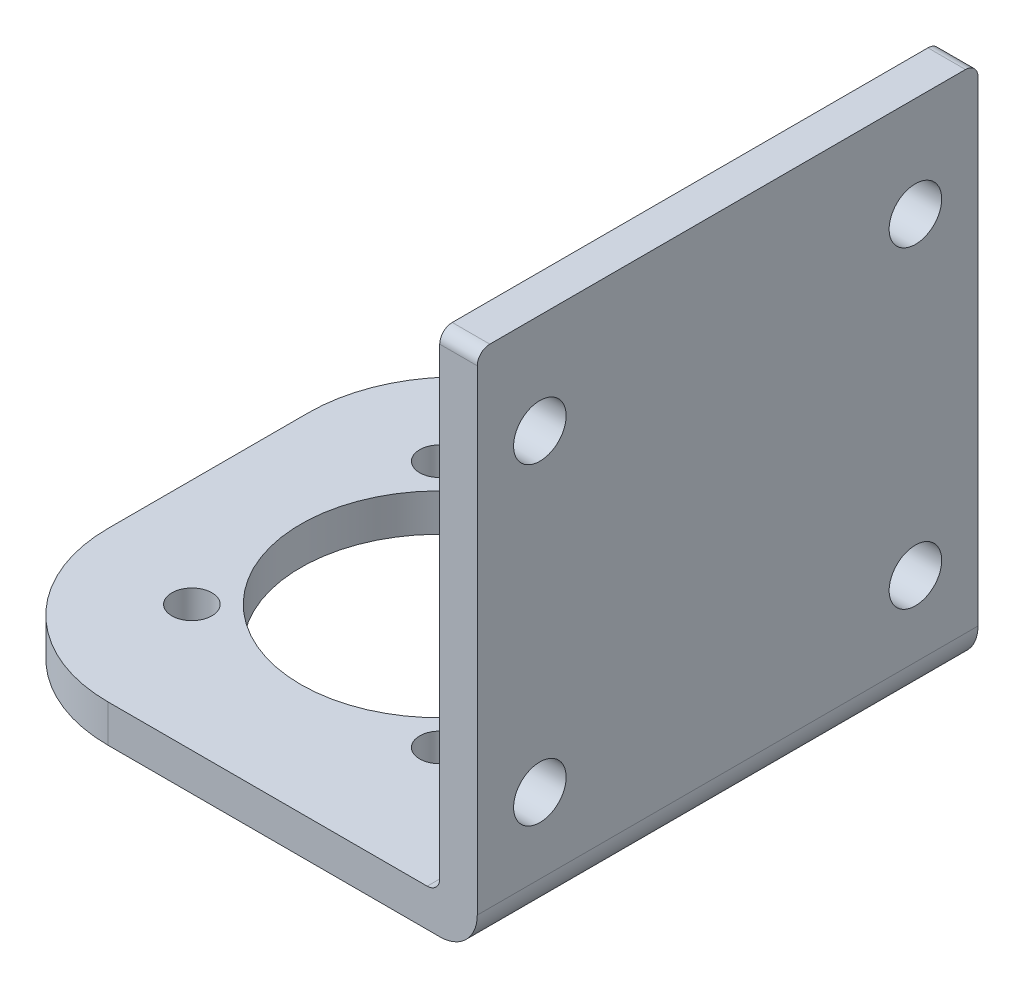
ISO-10303-21;
HEADER;
FILE_DESCRIPTION(('STEP AP214'),'2;1');
FILE_NAME('part.step','',(''),(''),'','','');
FILE_SCHEMA(('AUTOMOTIVE_DESIGN { 1 0 10303 214 1 1 1 1 }'));
ENDSEC;
DATA;
#1=APPLICATION_CONTEXT('core data for automotive mechanical design processes');
#2=APPLICATION_PROTOCOL_DEFINITION('international standard','automotive_design',2000,#1);
#3=PRODUCT_CONTEXT('',#1,'mechanical');
#4=PRODUCT('Part','Part','',(#3));
#5=PRODUCT_RELATED_PRODUCT_CATEGORY('part','',(#4));
#6=PRODUCT_DEFINITION_FORMATION('','',#4);
#7=PRODUCT_DEFINITION_CONTEXT('part definition',#1,'design');
#8=PRODUCT_DEFINITION('design','',#6,#7);
#9=PRODUCT_DEFINITION_SHAPE('','',#8);
#10=(LENGTH_UNIT() NAMED_UNIT(*) SI_UNIT(.MILLI.,.METRE.));
#11=(NAMED_UNIT(*) PLANE_ANGLE_UNIT() SI_UNIT($,.RADIAN.));
#12=(NAMED_UNIT(*) SI_UNIT($,.STERADIAN.) SOLID_ANGLE_UNIT());
#13=UNCERTAINTY_MEASURE_WITH_UNIT(LENGTH_MEASURE(1.E-05),#10,'distance_accuracy_value','');
#14=(GEOMETRIC_REPRESENTATION_CONTEXT(3) GLOBAL_UNCERTAINTY_ASSIGNED_CONTEXT((#13)) GLOBAL_UNIT_ASSIGNED_CONTEXT((#10,
#11,#12)) REPRESENTATION_CONTEXT('',''));
#15=CARTESIAN_POINT('',(0.,0.,0.));
#16=DIRECTION('',(0.,0.,1.));
#17=DIRECTION('',(1.,0.,0.));
#18=AXIS2_PLACEMENT_3D('',#15,#16,#17);
#19=CARTESIAN_POINT('',(38.5,0.,40.));
#20=DIRECTION('',(-1.,0.,0.));
#21=DIRECTION('',(0.,0.,1.));
#22=AXIS2_PLACEMENT_3D('',#19,#20,#21);
#23=PLANE('',#22);
#24=CARTESIAN_POINT('',(38.5,34.,5.00000000000001));
#25=DIRECTION('',(1.,0.,0.));
#26=DIRECTION('',(0.,0.,-1.));
#27=AXIS2_PLACEMENT_3D('',#24,#25,#26);
#28=CIRCLE('',#27,2.1);
#29=CARTESIAN_POINT('',(38.5,34.,2.90000000000001));
#30=VERTEX_POINT('',#29);
#31=EDGE_CURVE('E229',#30,#30,#28,.T.);
#32=ORIENTED_EDGE('',*,*,#31,.T.);
#33=EDGE_LOOP('',(#32));
#34=FACE_BOUND('',#33,.T.);
#35=CARTESIAN_POINT('',(38.5,9.,35.));
#36=DIRECTION('',(1.,0.,0.));
#37=DIRECTION('',(0.,0.,-1.));
#38=AXIS2_PLACEMENT_3D('',#35,#36,#37);
#39=CIRCLE('',#38,2.1);
#40=CARTESIAN_POINT('',(38.5,9.,32.9));
#41=VERTEX_POINT('',#40);
#42=EDGE_CURVE('E235',#41,#41,#39,.T.);
#43=ORIENTED_EDGE('',*,*,#42,.T.);
#44=EDGE_LOOP('',(#43));
#45=FACE_BOUND('',#44,.T.);
#46=CARTESIAN_POINT('',(38.5,9.,5.00000000000001));
#47=DIRECTION('',(1.,0.,0.));
#48=DIRECTION('',(0.,0.,-1.));
#49=AXIS2_PLACEMENT_3D('',#46,#47,#48);
#50=CIRCLE('',#49,2.1);
#51=CARTESIAN_POINT('',(38.5,9.,2.90000000000001));
#52=VERTEX_POINT('',#51);
#53=EDGE_CURVE('E236',#52,#52,#50,.T.);
#54=ORIENTED_EDGE('',*,*,#53,.T.);
#55=EDGE_LOOP('',(#54));
#56=FACE_BOUND('',#55,.T.);
#57=CARTESIAN_POINT('',(38.5,34.,35.));
#58=DIRECTION('',(1.,0.,0.));
#59=DIRECTION('',(0.,0.,-1.));
#60=AXIS2_PLACEMENT_3D('',#57,#58,#59);
#61=CIRCLE('',#60,2.1);
#62=CARTESIAN_POINT('',(38.5,34.,32.9));
#63=VERTEX_POINT('',#62);
#64=EDGE_CURVE('E219',#63,#63,#61,.T.);
#65=ORIENTED_EDGE('',*,*,#64,.T.);
#66=EDGE_LOOP('',(#65));
#67=FACE_BOUND('',#66,.T.);
#68=DIRECTION('',(0.,1.,0.));
#69=VECTOR('',#68,1.);
#70=CARTESIAN_POINT('',(38.5,0.,0.));
#71=LINE('',#70,#69);
#72=CARTESIAN_POINT('',(38.5,4.,0.));
#73=VERTEX_POINT('',#72);
#74=CARTESIAN_POINT('',(38.5,41.,0.));
#75=VERTEX_POINT('',#74);
#76=EDGE_CURVE('E218',#73,#75,#71,.T.);
#77=ORIENTED_EDGE('',*,*,#76,.F.);
#78=DIRECTION('',(0.,0.,-1.));
#79=VECTOR('',#78,1.);
#80=CARTESIAN_POINT('',(38.5,4.,40.));
#81=LINE('',#80,#79);
#82=CARTESIAN_POINT('',(38.5,4.,40.));
#83=VERTEX_POINT('',#82);
#84=EDGE_CURVE('E51',#73,#83,#81,.F.);
#85=ORIENTED_EDGE('',*,*,#84,.T.);
#86=DIRECTION('',(0.,1.,0.));
#87=VECTOR('',#86,1.);
#88=CARTESIAN_POINT('',(38.5,0.,40.));
#89=LINE('',#88,#87);
#90=CARTESIAN_POINT('',(38.5,41.,40.));
#91=VERTEX_POINT('',#90);
#92=EDGE_CURVE('E147',#83,#91,#89,.T.);
#93=ORIENTED_EDGE('',*,*,#92,.T.);
#94=CARTESIAN_POINT('',(38.5,41.,39.));
#95=DIRECTION('',(-1.,0.,0.));
#96=DIRECTION('',(0.,0.,1.));
#97=AXIS2_PLACEMENT_3D('',#94,#95,#96);
#98=CIRCLE('',#97,1.);
#99=CARTESIAN_POINT('',(38.5,42.,39.));
#100=VERTEX_POINT('',#99);
#101=EDGE_CURVE('E193',#91,#100,#98,.T.);
#102=ORIENTED_EDGE('',*,*,#101,.T.);
#103=DIRECTION('',(0.,0.,-1.));
#104=VECTOR('',#103,1.);
#105=CARTESIAN_POINT('',(38.5,42.,40.));
#106=LINE('',#105,#104);
#107=CARTESIAN_POINT('',(38.5,42.,1.));
#108=VERTEX_POINT('',#107);
#109=EDGE_CURVE('E156',#100,#108,#106,.T.);
#110=ORIENTED_EDGE('',*,*,#109,.T.);
#111=CARTESIAN_POINT('',(38.5,41.,1.));
#112=DIRECTION('',(-1.,0.,0.));
#113=DIRECTION('',(0.,0.,1.));
#114=AXIS2_PLACEMENT_3D('',#111,#112,#113);
#115=CIRCLE('',#114,1.);
#116=EDGE_CURVE('E195',#108,#75,#115,.T.);
#117=ORIENTED_EDGE('',*,*,#116,.T.);
#118=EDGE_LOOP('',(#77,#85,#93,#102,#110,#117));
#119=FACE_BOUND('',#118,.T.);
#120=ADVANCED_FACE('F36',(#34,#45,#56,#67,#119),#23,.T.);
#121=CARTESIAN_POINT('',(0.,3.,40.));
#122=DIRECTION('',(0.,1.,0.));
#123=DIRECTION('',(0.,0.,1.));
#124=AXIS2_PLACEMENT_3D('',#121,#122,#123);
#125=PLANE('',#124);
#126=CARTESIAN_POINT('',(8.6005050633883,3.,10.1005050633884));
#127=DIRECTION('',(0.,-1.,0.));
#128=DIRECTION('',(0.,0.,-1.));
#129=AXIS2_PLACEMENT_3D('',#126,#127,#128);
#130=CIRCLE('',#129,1.6);
#131=CARTESIAN_POINT('',(8.6005050633883,3.,8.50050506338838));
#132=VERTEX_POINT('',#131);
#133=EDGE_CURVE('E259',#132,#132,#130,.T.);
#134=ORIENTED_EDGE('',*,*,#133,.T.);
#135=EDGE_LOOP('',(#134));
#136=FACE_BOUND('',#135,.T.);
#137=CARTESIAN_POINT('',(28.3994949366117,3.,10.1005050633883));
#138=DIRECTION('',(0.,-1.,0.));
#139=DIRECTION('',(0.,0.,-1.));
#140=AXIS2_PLACEMENT_3D('',#137,#138,#139);
#141=CIRCLE('',#140,1.6);
#142=CARTESIAN_POINT('',(28.3994949366117,3.,8.50050506338834));
#143=VERTEX_POINT('',#142);
#144=EDGE_CURVE('E265',#143,#143,#141,.T.);
#145=ORIENTED_EDGE('',*,*,#144,.T.);
#146=EDGE_LOOP('',(#145));
#147=FACE_BOUND('',#146,.T.);
#148=CARTESIAN_POINT('',(28.3994949366116,3.,29.8994949366117));
#149=DIRECTION('',(0.,-1.,0.));
#150=DIRECTION('',(0.,0.,-1.));
#151=AXIS2_PLACEMENT_3D('',#148,#149,#150);
#152=CIRCLE('',#151,1.6);
#153=CARTESIAN_POINT('',(28.3994949366116,3.,28.2994949366117));
#154=VERTEX_POINT('',#153);
#155=EDGE_CURVE('E271',#154,#154,#152,.T.);
#156=ORIENTED_EDGE('',*,*,#155,.T.);
#157=EDGE_LOOP('',(#156));
#158=FACE_BOUND('',#157,.T.);
#159=CARTESIAN_POINT('',(8.60050506338826,3.,29.8994949366116));
#160=DIRECTION('',(0.,-1.,0.));
#161=DIRECTION('',(0.,0.,-1.));
#162=AXIS2_PLACEMENT_3D('',#159,#160,#161);
#163=CIRCLE('',#162,1.6);
#164=CARTESIAN_POINT('',(8.60050506338826,3.,28.2994949366116));
#165=VERTEX_POINT('',#164);
#166=EDGE_CURVE('E253',#165,#165,#163,.T.);
#167=ORIENTED_EDGE('',*,*,#166,.T.);
#168=EDGE_LOOP('',(#167));
#169=FACE_BOUND('',#168,.T.);
#170=CARTESIAN_POINT('',(18.5,3.,20.));
#171=DIRECTION('',(0.,-1.,0.));
#172=DIRECTION('',(0.,0.,-1.));
#173=AXIS2_PLACEMENT_3D('',#170,#171,#172);
#174=CIRCLE('',#173,11.1);
#175=CARTESIAN_POINT('',(18.5,3.,8.9));
#176=VERTEX_POINT('',#175);
#177=EDGE_CURVE('E247',#176,#176,#174,.T.);
#178=ORIENTED_EDGE('',*,*,#177,.T.);
#179=EDGE_LOOP('',(#178));
#180=FACE_BOUND('',#179,.T.);
#181=DIRECTION('',(1.,0.,0.));
#182=VECTOR('',#181,1.);
#183=CARTESIAN_POINT('',(0.,3.,40.));
#184=LINE('',#183,#182);
#185=CARTESIAN_POINT('',(12.,3.,40.));
#186=VERTEX_POINT('',#185);
#187=CARTESIAN_POINT('',(37.5,3.,40.));
#188=VERTEX_POINT('',#187);
#189=EDGE_CURVE('E150',#186,#188,#184,.T.);
#190=ORIENTED_EDGE('',*,*,#189,.T.);
#191=DIRECTION('',(0.,0.,-1.));
#192=VECTOR('',#191,1.);
#193=CARTESIAN_POINT('',(37.5,3.,0.));
#194=LINE('',#193,#192);
#195=CARTESIAN_POINT('',(37.5,3.,0.));
#196=VERTEX_POINT('',#195);
#197=EDGE_CURVE('E206',#188,#196,#194,.T.);
#198=ORIENTED_EDGE('',*,*,#197,.T.);
#199=DIRECTION('',(1.,0.,0.));
#200=VECTOR('',#199,1.);
#201=CARTESIAN_POINT('',(0.,3.,0.));
#202=LINE('',#201,#200);
#203=CARTESIAN_POINT('',(12.,3.,0.));
#204=VERTEX_POINT('',#203);
#205=EDGE_CURVE('E152',#204,#196,#202,.T.);
#206=ORIENTED_EDGE('',*,*,#205,.F.);
#207=CARTESIAN_POINT('',(12.,3.,12.));
#208=DIRECTION('',(0.,1.,0.));
#209=DIRECTION('',(0.,0.,1.));
#210=AXIS2_PLACEMENT_3D('',#207,#208,#209);
#211=CIRCLE('',#210,12.);
#212=CARTESIAN_POINT('',(0.,3.,12.));
#213=VERTEX_POINT('',#212);
#214=EDGE_CURVE('E175',#204,#213,#211,.T.);
#215=ORIENTED_EDGE('',*,*,#214,.T.);
#216=DIRECTION('',(0.,0.,-1.));
#217=VECTOR('',#216,1.);
#218=CARTESIAN_POINT('',(0.,3.,40.));
#219=LINE('',#218,#217);
#220=CARTESIAN_POINT('',(0.,3.,28.));
#221=VERTEX_POINT('',#220);
#222=EDGE_CURVE('E142',#221,#213,#219,.T.);
#223=ORIENTED_EDGE('',*,*,#222,.F.);
#224=CARTESIAN_POINT('',(12.,3.,28.));
#225=DIRECTION('',(0.,1.,0.));
#226=DIRECTION('',(0.,0.,1.));
#227=AXIS2_PLACEMENT_3D('',#224,#225,#226);
#228=CIRCLE('',#227,12.);
#229=EDGE_CURVE('E173',#221,#186,#228,.T.);
#230=ORIENTED_EDGE('',*,*,#229,.T.);
#231=EDGE_LOOP('',(#190,#198,#206,#215,#223,#230));
#232=FACE_BOUND('',#231,.T.);
#233=ADVANCED_FACE('F213',(#136,#147,#158,#169,#180,#232),#125,.T.);
#234=CARTESIAN_POINT('',(0.,0.,40.));
#235=DIRECTION('',(-1.,0.,0.));
#236=DIRECTION('',(0.,0.,1.));
#237=AXIS2_PLACEMENT_3D('',#234,#235,#236);
#238=PLANE('',#237);
#239=ORIENTED_EDGE('',*,*,#222,.T.);
#240=DIRECTION('',(0.,1.,0.));
#241=VECTOR('',#240,1.);
#242=CARTESIAN_POINT('',(0.,0.,12.));
#243=LINE('',#242,#241);
#244=CARTESIAN_POINT('',(0.,0.,12.));
#245=VERTEX_POINT('',#244);
#246=EDGE_CURVE('E180',#213,#245,#243,.F.);
#247=ORIENTED_EDGE('',*,*,#246,.T.);
#248=DIRECTION('',(0.,0.,-1.));
#249=VECTOR('',#248,1.);
#250=CARTESIAN_POINT('',(0.,0.,40.));
#251=LINE('',#250,#249);
#252=CARTESIAN_POINT('',(0.,0.,28.));
#253=VERTEX_POINT('',#252);
#254=EDGE_CURVE('E162',#253,#245,#251,.T.);
#255=ORIENTED_EDGE('',*,*,#254,.F.);
#256=DIRECTION('',(0.,1.,0.));
#257=VECTOR('',#256,1.);
#258=CARTESIAN_POINT('',(0.,0.,28.));
#259=LINE('',#258,#257);
#260=EDGE_CURVE('E177',#253,#221,#259,.T.);
#261=ORIENTED_EDGE('',*,*,#260,.T.);
#262=EDGE_LOOP('',(#239,#247,#255,#261));
#263=FACE_BOUND('',#262,.T.);
#264=ADVANCED_FACE('F293',(#263),#238,.T.);
#265=CARTESIAN_POINT('',(0.,0.,40.));
#266=DIRECTION('',(0.,1.,0.));
#267=DIRECTION('',(0.,0.,1.));
#268=AXIS2_PLACEMENT_3D('',#265,#266,#267);
#269=PLANE('',#268);
#270=CARTESIAN_POINT('',(8.6005050633883,0.,10.1005050633884));
#271=DIRECTION('',(0.,-1.,0.));
#272=DIRECTION('',(0.,0.,-1.));
#273=AXIS2_PLACEMENT_3D('',#270,#271,#272);
#274=CIRCLE('',#273,1.6);
#275=CARTESIAN_POINT('',(8.6005050633883,0.,8.50050506338838));
#276=VERTEX_POINT('',#275);
#277=EDGE_CURVE('E256',#276,#276,#274,.T.);
#278=ORIENTED_EDGE('',*,*,#277,.F.);
#279=EDGE_LOOP('',(#278));
#280=FACE_BOUND('',#279,.T.);
#281=CARTESIAN_POINT('',(28.3994949366117,0.,10.1005050633883));
#282=DIRECTION('',(0.,-1.,0.));
#283=DIRECTION('',(0.,0.,-1.));
#284=AXIS2_PLACEMENT_3D('',#281,#282,#283);
#285=CIRCLE('',#284,1.6);
#286=CARTESIAN_POINT('',(28.3994949366117,0.,8.50050506338834));
#287=VERTEX_POINT('',#286);
#288=EDGE_CURVE('E262',#287,#287,#285,.T.);
#289=ORIENTED_EDGE('',*,*,#288,.F.);
#290=EDGE_LOOP('',(#289));
#291=FACE_BOUND('',#290,.T.);
#292=CARTESIAN_POINT('',(28.3994949366116,0.,29.8994949366117));
#293=DIRECTION('',(0.,-1.,0.));
#294=DIRECTION('',(0.,0.,-1.));
#295=AXIS2_PLACEMENT_3D('',#292,#293,#294);
#296=CIRCLE('',#295,1.6);
#297=CARTESIAN_POINT('',(28.3994949366116,0.,28.2994949366117));
#298=VERTEX_POINT('',#297);
#299=EDGE_CURVE('E268',#298,#298,#296,.T.);
#300=ORIENTED_EDGE('',*,*,#299,.F.);
#301=EDGE_LOOP('',(#300));
#302=FACE_BOUND('',#301,.T.);
#303=CARTESIAN_POINT('',(8.60050506338826,0.,29.8994949366116));
#304=DIRECTION('',(0.,-1.,0.));
#305=DIRECTION('',(0.,0.,-1.));
#306=AXIS2_PLACEMENT_3D('',#303,#304,#305);
#307=CIRCLE('',#306,1.6);
#308=CARTESIAN_POINT('',(8.60050506338826,0.,28.2994949366116));
#309=VERTEX_POINT('',#308);
#310=EDGE_CURVE('E274',#309,#309,#307,.T.);
#311=ORIENTED_EDGE('',*,*,#310,.F.);
#312=EDGE_LOOP('',(#311));
#313=FACE_BOUND('',#312,.T.);
#314=CARTESIAN_POINT('',(18.5,0.,20.));
#315=DIRECTION('',(0.,-1.,0.));
#316=DIRECTION('',(0.,0.,-1.));
#317=AXIS2_PLACEMENT_3D('',#314,#315,#316);
#318=CIRCLE('',#317,11.1);
#319=CARTESIAN_POINT('',(18.5,0.,8.9));
#320=VERTEX_POINT('',#319);
#321=EDGE_CURVE('E250',#320,#320,#318,.T.);
#322=ORIENTED_EDGE('',*,*,#321,.F.);
#323=EDGE_LOOP('',(#322));
#324=FACE_BOUND('',#323,.T.);
#325=ORIENTED_EDGE('',*,*,#254,.T.);
#326=CARTESIAN_POINT('',(12.,0.,12.));
#327=DIRECTION('',(0.,1.,0.));
#328=DIRECTION('',(0.,0.,1.));
#329=AXIS2_PLACEMENT_3D('',#326,#327,#328);
#330=CIRCLE('',#329,12.);
#331=CARTESIAN_POINT('',(12.,0.,0.));
#332=VERTEX_POINT('',#331);
#333=EDGE_CURVE('E184',#245,#332,#330,.F.);
#334=ORIENTED_EDGE('',*,*,#333,.T.);
#335=DIRECTION('',(1.,0.,0.));
#336=VECTOR('',#335,1.);
#337=CARTESIAN_POINT('',(0.,0.,0.));
#338=LINE('',#337,#336);
#339=CARTESIAN_POINT('',(38.5,0.,0.));
#340=VERTEX_POINT('',#339);
#341=EDGE_CURVE('E148',#332,#340,#338,.T.);
#342=ORIENTED_EDGE('',*,*,#341,.T.);
#343=DIRECTION('',(0.,0.,-1.));
#344=VECTOR('',#343,1.);
#345=CARTESIAN_POINT('',(38.5,0.,40.));
#346=LINE('',#345,#344);
#347=CARTESIAN_POINT('',(38.5,0.,40.));
#348=VERTEX_POINT('',#347);
#349=EDGE_CURVE('E130',#340,#348,#346,.F.);
#350=ORIENTED_EDGE('',*,*,#349,.T.);
#351=DIRECTION('',(1.,0.,0.));
#352=VECTOR('',#351,1.);
#353=CARTESIAN_POINT('',(0.,0.,40.));
#354=LINE('',#353,#352);
#355=CARTESIAN_POINT('',(12.,0.,40.));
#356=VERTEX_POINT('',#355);
#357=EDGE_CURVE('E223',#356,#348,#354,.T.);
#358=ORIENTED_EDGE('',*,*,#357,.F.);
#359=CARTESIAN_POINT('',(12.,0.,28.));
#360=DIRECTION('',(0.,1.,0.));
#361=DIRECTION('',(0.,0.,1.));
#362=AXIS2_PLACEMENT_3D('',#359,#360,#361);
#363=CIRCLE('',#362,12.);
#364=EDGE_CURVE('E182',#356,#253,#363,.F.);
#365=ORIENTED_EDGE('',*,*,#364,.T.);
#366=EDGE_LOOP('',(#325,#334,#342,#350,#358,#365));
#367=FACE_BOUND('',#366,.T.);
#368=ADVANCED_FACE('F290',(#280,#291,#302,#313,#324,#367),#269,.F.);
#369=CARTESIAN_POINT('',(41.5,0.,40.));
#370=DIRECTION('',(-1.,0.,0.));
#371=DIRECTION('',(0.,0.,1.));
#372=AXIS2_PLACEMENT_3D('',#369,#370,#371);
#373=PLANE('',#372);
#374=CARTESIAN_POINT('',(41.5,34.,5.00000000000001));
#375=DIRECTION('',(1.,0.,0.));
#376=DIRECTION('',(0.,0.,-1.));
#377=AXIS2_PLACEMENT_3D('',#374,#375,#376);
#378=CIRCLE('',#377,2.1);
#379=CARTESIAN_POINT('',(41.5,34.,2.90000000000001));
#380=VERTEX_POINT('',#379);
#381=EDGE_CURVE('E239',#380,#380,#378,.T.);
#382=ORIENTED_EDGE('',*,*,#381,.F.);
#383=EDGE_LOOP('',(#382));
#384=FACE_BOUND('',#383,.T.);
#385=CARTESIAN_POINT('',(41.5,9.,35.));
#386=DIRECTION('',(1.,0.,0.));
#387=DIRECTION('',(0.,0.,-1.));
#388=AXIS2_PLACEMENT_3D('',#385,#386,#387);
#389=CIRCLE('',#388,2.1);
#390=CARTESIAN_POINT('',(41.5,9.,32.9));
#391=VERTEX_POINT('',#390);
#392=EDGE_CURVE('E232',#391,#391,#389,.T.);
#393=ORIENTED_EDGE('',*,*,#392,.F.);
#394=EDGE_LOOP('',(#393));
#395=FACE_BOUND('',#394,.T.);
#396=CARTESIAN_POINT('',(41.5,9.,5.00000000000001));
#397=DIRECTION('',(1.,0.,0.));
#398=DIRECTION('',(0.,0.,-1.));
#399=AXIS2_PLACEMENT_3D('',#396,#397,#398);
#400=CIRCLE('',#399,2.1);
#401=CARTESIAN_POINT('',(41.5,9.,2.90000000000001));
#402=VERTEX_POINT('',#401);
#403=EDGE_CURVE('E244',#402,#402,#400,.T.);
#404=ORIENTED_EDGE('',*,*,#403,.F.);
#405=EDGE_LOOP('',(#404));
#406=FACE_BOUND('',#405,.T.);
#407=CARTESIAN_POINT('',(41.5,34.,35.));
#408=DIRECTION('',(1.,0.,0.));
#409=DIRECTION('',(0.,0.,-1.));
#410=AXIS2_PLACEMENT_3D('',#407,#408,#409);
#411=CIRCLE('',#410,2.1);
#412=CARTESIAN_POINT('',(41.5,34.,32.9));
#413=VERTEX_POINT('',#412);
#414=EDGE_CURVE('E226',#413,#413,#411,.T.);
#415=ORIENTED_EDGE('',*,*,#414,.F.);
#416=EDGE_LOOP('',(#415));
#417=FACE_BOUND('',#416,.T.);
#418=DIRECTION('',(0.,1.,0.));
#419=VECTOR('',#418,1.);
#420=CARTESIAN_POINT('',(41.5,0.,0.));
#421=LINE('',#420,#419);
#422=CARTESIAN_POINT('',(41.5,3.,0.));
#423=VERTEX_POINT('',#422);
#424=CARTESIAN_POINT('',(41.5,41.,0.));
#425=VERTEX_POINT('',#424);
#426=EDGE_CURVE('E138',#423,#425,#421,.T.);
#427=ORIENTED_EDGE('',*,*,#426,.T.);
#428=CARTESIAN_POINT('',(41.5,41.,1.));
#429=DIRECTION('',(-1.,0.,0.));
#430=DIRECTION('',(0.,0.,1.));
#431=AXIS2_PLACEMENT_3D('',#428,#429,#430);
#432=CIRCLE('',#431,1.);
#433=CARTESIAN_POINT('',(41.5,42.,1.));
#434=VERTEX_POINT('',#433);
#435=EDGE_CURVE('E201',#425,#434,#432,.F.);
#436=ORIENTED_EDGE('',*,*,#435,.T.);
#437=DIRECTION('',(0.,0.,-1.));
#438=VECTOR('',#437,1.);
#439=CARTESIAN_POINT('',(41.5,42.,40.));
#440=LINE('',#439,#438);
#441=CARTESIAN_POINT('',(41.5,42.,39.));
#442=VERTEX_POINT('',#441);
#443=EDGE_CURVE('E159',#442,#434,#440,.T.);
#444=ORIENTED_EDGE('',*,*,#443,.F.);
#445=CARTESIAN_POINT('',(41.5,41.,39.));
#446=DIRECTION('',(-1.,0.,0.));
#447=DIRECTION('',(0.,0.,1.));
#448=AXIS2_PLACEMENT_3D('',#445,#446,#447);
#449=CIRCLE('',#448,1.);
#450=CARTESIAN_POINT('',(41.5,41.,40.));
#451=VERTEX_POINT('',#450);
#452=EDGE_CURVE('E199',#442,#451,#449,.F.);
#453=ORIENTED_EDGE('',*,*,#452,.T.);
#454=DIRECTION('',(0.,1.,0.));
#455=VECTOR('',#454,1.);
#456=CARTESIAN_POINT('',(41.5,0.,40.));
#457=LINE('',#456,#455);
#458=CARTESIAN_POINT('',(41.5,3.,40.));
#459=VERTEX_POINT('',#458);
#460=EDGE_CURVE('E141',#459,#451,#457,.T.);
#461=ORIENTED_EDGE('',*,*,#460,.F.);
#462=DIRECTION('',(0.,0.,-1.));
#463=VECTOR('',#462,1.);
#464=CARTESIAN_POINT('',(41.5,3.,40.));
#465=LINE('',#464,#463);
#466=EDGE_CURVE('E128',#459,#423,#465,.T.);
#467=ORIENTED_EDGE('',*,*,#466,.T.);
#468=EDGE_LOOP('',(#427,#436,#444,#453,#461,#467));
#469=FACE_BOUND('',#468,.T.);
#470=ADVANCED_FACE('F137',(#384,#395,#406,#417,#469),#373,.F.);
#471=CARTESIAN_POINT('',(0.,42.,40.));
#472=DIRECTION('',(0.,-1.,0.));
#473=DIRECTION('',(0.,0.,-1.));
#474=AXIS2_PLACEMENT_3D('',#471,#472,#473);
#475=PLANE('',#474);
#476=ORIENTED_EDGE('',*,*,#443,.T.);
#477=DIRECTION('',(-1.,0.,0.));
#478=VECTOR('',#477,1.);
#479=CARTESIAN_POINT('',(0.,42.,1.));
#480=LINE('',#479,#478);
#481=EDGE_CURVE('E190',#434,#108,#480,.T.);
#482=ORIENTED_EDGE('',*,*,#481,.T.);
#483=ORIENTED_EDGE('',*,*,#109,.F.);
#484=DIRECTION('',(-1.,0.,0.));
#485=VECTOR('',#484,1.);
#486=CARTESIAN_POINT('',(41.5,42.,39.));
#487=LINE('',#486,#485);
#488=EDGE_CURVE('E188',#100,#442,#487,.F.);
#489=ORIENTED_EDGE('',*,*,#488,.T.);
#490=EDGE_LOOP('',(#476,#482,#483,#489));
#491=FACE_BOUND('',#490,.T.);
#492=ADVANCED_FACE('F346',(#491),#475,.F.);
#493=CARTESIAN_POINT('',(0.,0.,40.));
#494=DIRECTION('',(0.,0.,1.));
#495=DIRECTION('',(1.,0.,0.));
#496=AXIS2_PLACEMENT_3D('',#493,#494,#495);
#497=PLANE('',#496);
#498=ORIENTED_EDGE('',*,*,#460,.T.);
#499=DIRECTION('',(-1.,0.,0.));
#500=VECTOR('',#499,1.);
#501=CARTESIAN_POINT('',(38.5,41.,40.));
#502=LINE('',#501,#500);
#503=EDGE_CURVE('E203',#451,#91,#502,.T.);
#504=ORIENTED_EDGE('',*,*,#503,.T.);
#505=ORIENTED_EDGE('',*,*,#92,.F.);
#506=CARTESIAN_POINT('',(37.5,4.,40.));
#507=DIRECTION('',(0.,0.,1.));
#508=DIRECTION('',(1.,0.,0.));
#509=AXIS2_PLACEMENT_3D('',#506,#507,#508);
#510=CIRCLE('',#509,1.);
#511=EDGE_CURVE('E11',#83,#188,#510,.F.);
#512=ORIENTED_EDGE('',*,*,#511,.T.);
#513=ORIENTED_EDGE('',*,*,#189,.F.);
#514=DIRECTION('',(0.,1.,0.));
#515=VECTOR('',#514,1.);
#516=CARTESIAN_POINT('',(12.,0.,40.));
#517=LINE('',#516,#515);
#518=EDGE_CURVE('E186',#186,#356,#517,.F.);
#519=ORIENTED_EDGE('',*,*,#518,.T.);
#520=ORIENTED_EDGE('',*,*,#357,.T.);
#521=CARTESIAN_POINT('',(38.5,3.,40.));
#522=DIRECTION('',(0.,0.,1.));
#523=DIRECTION('',(1.,0.,0.));
#524=AXIS2_PLACEMENT_3D('',#521,#522,#523);
#525=CIRCLE('',#524,3.);
#526=EDGE_CURVE('E168',#348,#459,#525,.T.);
#527=ORIENTED_EDGE('',*,*,#526,.T.);
#528=EDGE_LOOP('',(#498,#504,#505,#512,#513,#519,#520,#527));
#529=FACE_BOUND('',#528,.T.);
#530=ADVANCED_FACE('F312',(#529),#497,.T.);
#531=CARTESIAN_POINT('',(0.,0.,0.));
#532=DIRECTION('',(0.,0.,1.));
#533=DIRECTION('',(1.,0.,0.));
#534=AXIS2_PLACEMENT_3D('',#531,#532,#533);
#535=PLANE('',#534);
#536=ORIENTED_EDGE('',*,*,#205,.T.);
#537=CARTESIAN_POINT('',(37.5,4.,0.));
#538=DIRECTION('',(0.,0.,1.));
#539=DIRECTION('',(1.,0.,0.));
#540=AXIS2_PLACEMENT_3D('',#537,#538,#539);
#541=CIRCLE('',#540,1.);
#542=EDGE_CURVE('E44',#196,#73,#541,.T.);
#543=ORIENTED_EDGE('',*,*,#542,.T.);
#544=ORIENTED_EDGE('',*,*,#76,.T.);
#545=DIRECTION('',(-1.,0.,0.));
#546=VECTOR('',#545,1.);
#547=CARTESIAN_POINT('',(0.,41.,0.));
#548=LINE('',#547,#546);
#549=EDGE_CURVE('E146',#75,#425,#548,.F.);
#550=ORIENTED_EDGE('',*,*,#549,.T.);
#551=ORIENTED_EDGE('',*,*,#426,.F.);
#552=CARTESIAN_POINT('',(38.5,3.,0.));
#553=DIRECTION('',(0.,0.,1.));
#554=DIRECTION('',(1.,0.,0.));
#555=AXIS2_PLACEMENT_3D('',#552,#553,#554);
#556=CIRCLE('',#555,3.);
#557=EDGE_CURVE('E124',#423,#340,#556,.F.);
#558=ORIENTED_EDGE('',*,*,#557,.T.);
#559=ORIENTED_EDGE('',*,*,#341,.F.);
#560=DIRECTION('',(0.,1.,0.));
#561=VECTOR('',#560,1.);
#562=CARTESIAN_POINT('',(12.,3.,0.));
#563=LINE('',#562,#561);
#564=EDGE_CURVE('E170',#332,#204,#563,.T.);
#565=ORIENTED_EDGE('',*,*,#564,.T.);
#566=EDGE_LOOP('',(#536,#543,#544,#550,#551,#558,#559,#565));
#567=FACE_BOUND('',#566,.T.);
#568=ADVANCED_FACE('F144',(#567),#535,.F.);
#569=CARTESIAN_POINT('',(38.5,34.,35.));
#570=DIRECTION('',(1.,0.,0.));
#571=DIRECTION('',(0.,0.,-1.));
#572=AXIS2_PLACEMENT_3D('',#569,#570,#571);
#573=CYLINDRICAL_SURFACE('',#572,2.1);
#574=ORIENTED_EDGE('',*,*,#64,.F.);
#575=EDGE_LOOP('',(#574));
#576=FACE_BOUND('',#575,.T.);
#577=ORIENTED_EDGE('',*,*,#414,.T.);
#578=EDGE_LOOP('',(#577));
#579=FACE_BOUND('',#578,.T.);
#580=ADVANCED_FACE('F417',(#576,#579),#573,.F.);
#581=CARTESIAN_POINT('',(38.5,9.,5.00000000000001));
#582=DIRECTION('',(1.,0.,0.));
#583=DIRECTION('',(0.,0.,-1.));
#584=AXIS2_PLACEMENT_3D('',#581,#582,#583);
#585=CYLINDRICAL_SURFACE('',#584,2.1);
#586=ORIENTED_EDGE('',*,*,#53,.F.);
#587=EDGE_LOOP('',(#586));
#588=FACE_BOUND('',#587,.T.);
#589=ORIENTED_EDGE('',*,*,#403,.T.);
#590=EDGE_LOOP('',(#589));
#591=FACE_BOUND('',#590,.T.);
#592=ADVANCED_FACE('F429',(#588,#591),#585,.F.);
#593=CARTESIAN_POINT('',(38.5,9.,35.));
#594=DIRECTION('',(1.,0.,0.));
#595=DIRECTION('',(0.,0.,-1.));
#596=AXIS2_PLACEMENT_3D('',#593,#594,#595);
#597=CYLINDRICAL_SURFACE('',#596,2.1);
#598=ORIENTED_EDGE('',*,*,#42,.F.);
#599=EDGE_LOOP('',(#598));
#600=FACE_BOUND('',#599,.T.);
#601=ORIENTED_EDGE('',*,*,#392,.T.);
#602=EDGE_LOOP('',(#601));
#603=FACE_BOUND('',#602,.T.);
#604=ADVANCED_FACE('F436',(#600,#603),#597,.F.);
#605=CARTESIAN_POINT('',(38.5,34.,5.00000000000001));
#606=DIRECTION('',(1.,0.,0.));
#607=DIRECTION('',(0.,0.,-1.));
#608=AXIS2_PLACEMENT_3D('',#605,#606,#607);
#609=CYLINDRICAL_SURFACE('',#608,2.1);
#610=ORIENTED_EDGE('',*,*,#31,.F.);
#611=EDGE_LOOP('',(#610));
#612=FACE_BOUND('',#611,.T.);
#613=ORIENTED_EDGE('',*,*,#381,.T.);
#614=EDGE_LOOP('',(#613));
#615=FACE_BOUND('',#614,.T.);
#616=ADVANCED_FACE('F444',(#612,#615),#609,.F.);
#617=CARTESIAN_POINT('',(18.5,3.,20.));
#618=DIRECTION('',(0.,-1.,0.));
#619=DIRECTION('',(0.,0.,-1.));
#620=AXIS2_PLACEMENT_3D('',#617,#618,#619);
#621=CYLINDRICAL_SURFACE('',#620,11.1);
#622=ORIENTED_EDGE('',*,*,#177,.F.);
#623=EDGE_LOOP('',(#622));
#624=FACE_BOUND('',#623,.T.);
#625=ORIENTED_EDGE('',*,*,#321,.T.);
#626=EDGE_LOOP('',(#625));
#627=FACE_BOUND('',#626,.T.);
#628=ADVANCED_FACE('F286',(#624,#627),#621,.F.);
#629=CARTESIAN_POINT('',(8.60050506338826,3.,29.8994949366116));
#630=DIRECTION('',(0.,-1.,0.));
#631=DIRECTION('',(0.,0.,-1.));
#632=AXIS2_PLACEMENT_3D('',#629,#630,#631);
#633=CYLINDRICAL_SURFACE('',#632,1.6);
#634=ORIENTED_EDGE('',*,*,#166,.F.);
#635=EDGE_LOOP('',(#634));
#636=FACE_BOUND('',#635,.T.);
#637=ORIENTED_EDGE('',*,*,#310,.T.);
#638=EDGE_LOOP('',(#637));
#639=FACE_BOUND('',#638,.T.);
#640=ADVANCED_FACE('F282',(#636,#639),#633,.F.);
#641=CARTESIAN_POINT('',(28.3994949366116,3.,29.8994949366117));
#642=DIRECTION('',(0.,-1.,0.));
#643=DIRECTION('',(0.,0.,-1.));
#644=AXIS2_PLACEMENT_3D('',#641,#642,#643);
#645=CYLINDRICAL_SURFACE('',#644,1.6);
#646=ORIENTED_EDGE('',*,*,#155,.F.);
#647=EDGE_LOOP('',(#646));
#648=FACE_BOUND('',#647,.T.);
#649=ORIENTED_EDGE('',*,*,#299,.T.);
#650=EDGE_LOOP('',(#649));
#651=FACE_BOUND('',#650,.T.);
#652=ADVANCED_FACE('F285',(#648,#651),#645,.F.);
#653=CARTESIAN_POINT('',(28.3994949366117,3.,10.1005050633883));
#654=DIRECTION('',(0.,-1.,0.));
#655=DIRECTION('',(0.,0.,-1.));
#656=AXIS2_PLACEMENT_3D('',#653,#654,#655);
#657=CYLINDRICAL_SURFACE('',#656,1.6);
#658=ORIENTED_EDGE('',*,*,#144,.F.);
#659=EDGE_LOOP('',(#658));
#660=FACE_BOUND('',#659,.T.);
#661=ORIENTED_EDGE('',*,*,#288,.T.);
#662=EDGE_LOOP('',(#661));
#663=FACE_BOUND('',#662,.T.);
#664=ADVANCED_FACE('F470',(#660,#663),#657,.F.);
#665=CARTESIAN_POINT('',(8.6005050633883,3.,10.1005050633884));
#666=DIRECTION('',(0.,-1.,0.));
#667=DIRECTION('',(0.,0.,-1.));
#668=AXIS2_PLACEMENT_3D('',#665,#666,#667);
#669=CYLINDRICAL_SURFACE('',#668,1.6);
#670=ORIENTED_EDGE('',*,*,#133,.F.);
#671=EDGE_LOOP('',(#670));
#672=FACE_BOUND('',#671,.T.);
#673=ORIENTED_EDGE('',*,*,#277,.T.);
#674=EDGE_LOOP('',(#673));
#675=FACE_BOUND('',#674,.T.);
#676=ADVANCED_FACE('F333',(#672,#675),#669,.F.);
#677=CARTESIAN_POINT('',(38.5,3.,40.));
#678=DIRECTION('',(0.,0.,-1.));
#679=DIRECTION('',(-1.,0.,0.));
#680=AXIS2_PLACEMENT_3D('',#677,#678,#679);
#681=CYLINDRICAL_SURFACE('',#680,3.);
#682=ORIENTED_EDGE('',*,*,#526,.F.);
#683=ORIENTED_EDGE('',*,*,#349,.F.);
#684=ORIENTED_EDGE('',*,*,#557,.F.);
#685=ORIENTED_EDGE('',*,*,#466,.F.);
#686=EDGE_LOOP('',(#682,#683,#684,#685));
#687=FACE_BOUND('',#686,.T.);
#688=ADVANCED_FACE('F127',(#687),#681,.T.);
#689=CARTESIAN_POINT('',(12.,0.,12.));
#690=DIRECTION('',(0.,-1.,0.));
#691=DIRECTION('',(0.,0.,-1.));
#692=AXIS2_PLACEMENT_3D('',#689,#690,#691);
#693=CYLINDRICAL_SURFACE('',#692,12.);
#694=ORIENTED_EDGE('',*,*,#333,.F.);
#695=ORIENTED_EDGE('',*,*,#246,.F.);
#696=ORIENTED_EDGE('',*,*,#214,.F.);
#697=ORIENTED_EDGE('',*,*,#564,.F.);
#698=EDGE_LOOP('',(#694,#695,#696,#697));
#699=FACE_BOUND('',#698,.T.);
#700=ADVANCED_FACE('F306',(#699),#693,.T.);
#701=CARTESIAN_POINT('',(12.,0.,28.));
#702=DIRECTION('',(0.,1.,0.));
#703=DIRECTION('',(0.,0.,1.));
#704=AXIS2_PLACEMENT_3D('',#701,#702,#703);
#705=CYLINDRICAL_SURFACE('',#704,12.);
#706=ORIENTED_EDGE('',*,*,#364,.F.);
#707=ORIENTED_EDGE('',*,*,#518,.F.);
#708=ORIENTED_EDGE('',*,*,#229,.F.);
#709=ORIENTED_EDGE('',*,*,#260,.F.);
#710=EDGE_LOOP('',(#706,#707,#708,#709));
#711=FACE_BOUND('',#710,.T.);
#712=ADVANCED_FACE('F309',(#711),#705,.T.);
#713=CARTESIAN_POINT('',(0.,41.,1.));
#714=DIRECTION('',(-1.,0.,0.));
#715=DIRECTION('',(0.,0.,1.));
#716=AXIS2_PLACEMENT_3D('',#713,#714,#715);
#717=CYLINDRICAL_SURFACE('',#716,1.);
#718=ORIENTED_EDGE('',*,*,#435,.F.);
#719=ORIENTED_EDGE('',*,*,#549,.F.);
#720=ORIENTED_EDGE('',*,*,#116,.F.);
#721=ORIENTED_EDGE('',*,*,#481,.F.);
#722=EDGE_LOOP('',(#718,#719,#720,#721));
#723=FACE_BOUND('',#722,.T.);
#724=ADVANCED_FACE('F318',(#723),#717,.T.);
#725=CARTESIAN_POINT('',(0.,41.,39.));
#726=DIRECTION('',(1.,0.,0.));
#727=DIRECTION('',(0.,0.,-1.));
#728=AXIS2_PLACEMENT_3D('',#725,#726,#727);
#729=CYLINDRICAL_SURFACE('',#728,1.);
#730=ORIENTED_EDGE('',*,*,#452,.F.);
#731=ORIENTED_EDGE('',*,*,#488,.F.);
#732=ORIENTED_EDGE('',*,*,#101,.F.);
#733=ORIENTED_EDGE('',*,*,#503,.F.);
#734=EDGE_LOOP('',(#730,#731,#732,#733));
#735=FACE_BOUND('',#734,.T.);
#736=ADVANCED_FACE('F314',(#735),#729,.T.);
#737=CARTESIAN_POINT('',(37.5,4.,40.));
#738=DIRECTION('',(0.,0.,1.));
#739=DIRECTION('',(1.,0.,0.));
#740=AXIS2_PLACEMENT_3D('',#737,#738,#739);
#741=CYLINDRICAL_SURFACE('',#740,1.);
#742=ORIENTED_EDGE('',*,*,#511,.F.);
#743=ORIENTED_EDGE('',*,*,#84,.F.);
#744=ORIENTED_EDGE('',*,*,#542,.F.);
#745=ORIENTED_EDGE('',*,*,#197,.F.);
#746=EDGE_LOOP('',(#742,#743,#744,#745));
#747=FACE_BOUND('',#746,.T.);
#748=ADVANCED_FACE('F38',(#747),#741,.F.);
#749=CLOSED_SHELL('',(#120,#233,#264,#368,#470,#492,#530,#568,#580,#592,#604,#616,#628,#640,
#652,#664,#676,#688,#700,#712,#724,#736,#748));
#750=MANIFOLD_SOLID_BREP('B2',#749);
#751=ADVANCED_BREP_SHAPE_REPRESENTATION('',(#18,#750),#14);
#752=SHAPE_DEFINITION_REPRESENTATION(#9,#751);
ENDSEC;
END-ISO-10303-21;
